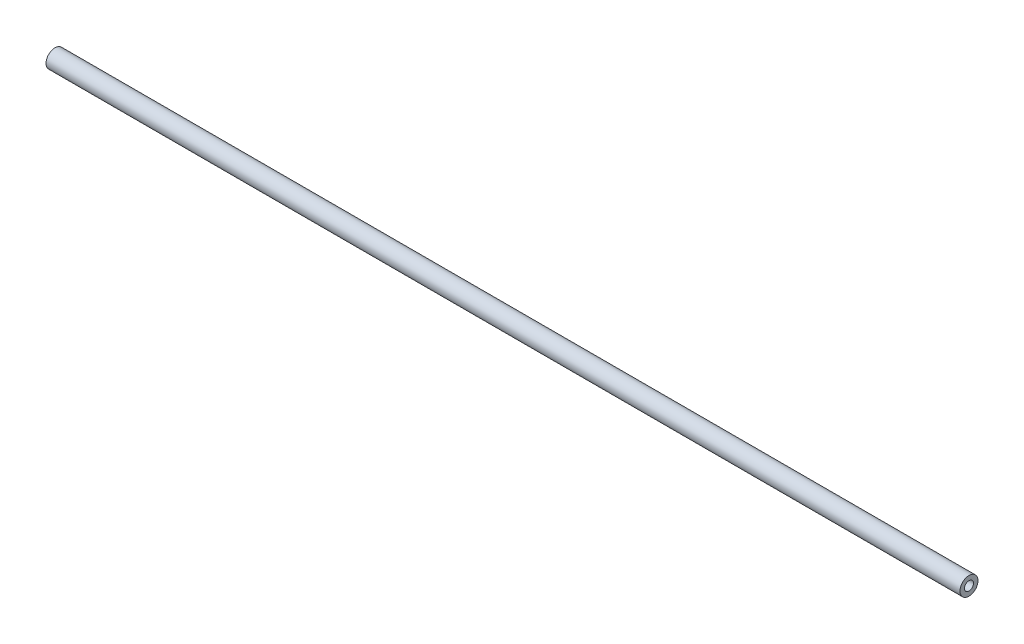
ISO-10303-21;
HEADER;
FILE_DESCRIPTION(('STEP AP214'),'2;1');
FILE_NAME('part.step','',(''),(''),'','','');
FILE_SCHEMA(('AUTOMOTIVE_DESIGN { 1 0 10303 214 1 1 1 1 }'));
ENDSEC;
DATA;
#1=APPLICATION_CONTEXT('core data for automotive mechanical design processes');
#2=APPLICATION_PROTOCOL_DEFINITION('international standard','automotive_design',2000,#1);
#3=PRODUCT_CONTEXT('',#1,'mechanical');
#4=PRODUCT('Part','Part','',(#3));
#5=PRODUCT_RELATED_PRODUCT_CATEGORY('part','',(#4));
#6=PRODUCT_DEFINITION_FORMATION('','',#4);
#7=PRODUCT_DEFINITION_CONTEXT('part definition',#1,'design');
#8=PRODUCT_DEFINITION('design','',#6,#7);
#9=PRODUCT_DEFINITION_SHAPE('','',#8);
#10=(LENGTH_UNIT() NAMED_UNIT(*) SI_UNIT(.MILLI.,.METRE.));
#11=(NAMED_UNIT(*) PLANE_ANGLE_UNIT() SI_UNIT($,.RADIAN.));
#12=(NAMED_UNIT(*) SI_UNIT($,.STERADIAN.) SOLID_ANGLE_UNIT());
#13=UNCERTAINTY_MEASURE_WITH_UNIT(LENGTH_MEASURE(1.E-05),#10,'distance_accuracy_value','');
#14=(GEOMETRIC_REPRESENTATION_CONTEXT(3) GLOBAL_UNCERTAINTY_ASSIGNED_CONTEXT((#13)) GLOBAL_UNIT_ASSIGNED_CONTEXT((#10,
#11,#12)) REPRESENTATION_CONTEXT('',''));
#15=CARTESIAN_POINT('',(0.,0.,0.));
#16=DIRECTION('',(0.,0.,1.));
#17=DIRECTION('',(1.,0.,0.));
#18=AXIS2_PLACEMENT_3D('',#15,#16,#17);
#19=CARTESIAN_POINT('',(186.5,0.,0.));
#20=DIRECTION('',(1.,0.,0.));
#21=DIRECTION('',(0.,0.,-1.));
#22=AXIS2_PLACEMENT_3D('',#19,#20,#21);
#23=PLANE('',#22);
#24=CARTESIAN_POINT('',(186.5,0.,0.));
#25=DIRECTION('',(1.,0.,0.));
#26=DIRECTION('',(0.,0.,-1.));
#27=AXIS2_PLACEMENT_3D('',#24,#25,#26);
#28=CIRCLE('',#27,4.);
#29=CARTESIAN_POINT('',(186.5,0.,-4.));
#30=VERTEX_POINT('',#29);
#31=EDGE_CURVE('E10',#30,#30,#28,.T.);
#32=ORIENTED_EDGE('',*,*,#31,.T.);
#33=EDGE_LOOP('',(#32));
#34=FACE_BOUND('',#33,.T.);
#35=CARTESIAN_POINT('',(186.5,0.,0.));
#36=DIRECTION('',(1.,0.,0.));
#37=DIRECTION('',(0.,0.,-1.));
#38=AXIS2_PLACEMENT_3D('',#35,#36,#37);
#39=CIRCLE('',#38,2.);
#40=CARTESIAN_POINT('',(186.5,0.,-2.));
#41=VERTEX_POINT('',#40);
#42=EDGE_CURVE('E39',#41,#41,#39,.T.);
#43=ORIENTED_EDGE('',*,*,#42,.F.);
#44=EDGE_LOOP('',(#43));
#45=FACE_BOUND('',#44,.T.);
#46=ADVANCED_FACE('F32',(#34,#45),#23,.T.);
#47=CARTESIAN_POINT('',(186.5,0.,0.));
#48=DIRECTION('',(-1.,0.,0.));
#49=DIRECTION('',(0.,0.,1.));
#50=AXIS2_PLACEMENT_3D('',#47,#48,#49);
#51=CYLINDRICAL_SURFACE('',#50,4.);
#52=ORIENTED_EDGE('',*,*,#31,.F.);
#53=EDGE_LOOP('',(#52));
#54=FACE_BOUND('',#53,.T.);
#55=CARTESIAN_POINT('',(-219.35,0.,0.));
#56=DIRECTION('',(-1.,0.,0.));
#57=DIRECTION('',(0.,0.,1.));
#58=AXIS2_PLACEMENT_3D('',#55,#56,#57);
#59=CIRCLE('',#58,4.);
#60=CARTESIAN_POINT('',(-219.35,0.,4.));
#61=VERTEX_POINT('',#60);
#62=EDGE_CURVE('E43',#61,#61,#59,.T.);
#63=ORIENTED_EDGE('',*,*,#62,.F.);
#64=EDGE_LOOP('',(#63));
#65=FACE_BOUND('',#64,.T.);
#66=ADVANCED_FACE('F34',(#54,#65),#51,.T.);
#67=CARTESIAN_POINT('',(186.5,0.,0.));
#68=DIRECTION('',(-1.,0.,0.));
#69=DIRECTION('',(0.,0.,1.));
#70=AXIS2_PLACEMENT_3D('',#67,#68,#69);
#71=CYLINDRICAL_SURFACE('',#70,2.);
#72=ORIENTED_EDGE('',*,*,#42,.T.);
#73=EDGE_LOOP('',(#72));
#74=FACE_BOUND('',#73,.T.);
#75=CARTESIAN_POINT('',(-219.35,0.,0.));
#76=DIRECTION('',(-1.,0.,0.));
#77=DIRECTION('',(0.,0.,1.));
#78=AXIS2_PLACEMENT_3D('',#75,#76,#77);
#79=CIRCLE('',#78,2.);
#80=CARTESIAN_POINT('',(-219.35,0.,2.));
#81=VERTEX_POINT('',#80);
#82=EDGE_CURVE('E47',#81,#81,#79,.T.);
#83=ORIENTED_EDGE('',*,*,#82,.T.);
#84=EDGE_LOOP('',(#83));
#85=FACE_BOUND('',#84,.T.);
#86=ADVANCED_FACE('F53',(#74,#85),#71,.F.);
#87=CARTESIAN_POINT('',(-219.35,0.,0.));
#88=DIRECTION('',(-1.,0.,0.));
#89=DIRECTION('',(0.,0.,1.));
#90=AXIS2_PLACEMENT_3D('',#87,#88,#89);
#91=PLANE('',#90);
#92=ORIENTED_EDGE('',*,*,#62,.T.);
#93=EDGE_LOOP('',(#92));
#94=FACE_BOUND('',#93,.T.);
#95=ORIENTED_EDGE('',*,*,#82,.F.);
#96=EDGE_LOOP('',(#95));
#97=FACE_BOUND('',#96,.T.);
#98=ADVANCED_FACE('F55',(#94,#97),#91,.T.);
#99=CLOSED_SHELL('',(#46,#66,#86,#98));
#100=MANIFOLD_SOLID_BREP('B2',#99);
#101=ADVANCED_BREP_SHAPE_REPRESENTATION('',(#18,#100),#14);
#102=SHAPE_DEFINITION_REPRESENTATION(#9,#101);
ENDSEC;
END-ISO-10303-21;
